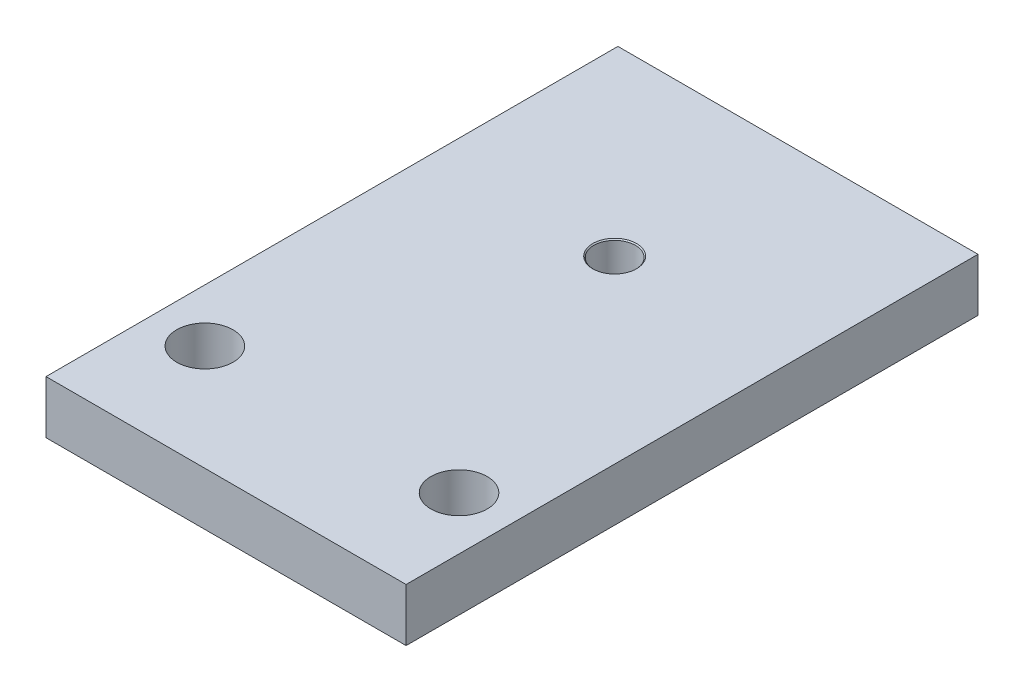
ISO-10303-21;
HEADER;
FILE_DESCRIPTION(('STEP AP214'),'2;1');
FILE_NAME('part.step','',(''),(''),'','','');
FILE_SCHEMA(('AUTOMOTIVE_DESIGN { 1 0 10303 214 1 1 1 1 }'));
ENDSEC;
DATA;
#1=APPLICATION_CONTEXT('core data for automotive mechanical design processes');
#2=APPLICATION_PROTOCOL_DEFINITION('international standard','automotive_design',2000,#1);
#3=PRODUCT_CONTEXT('',#1,'mechanical');
#4=PRODUCT('Part','Part','',(#3));
#5=PRODUCT_RELATED_PRODUCT_CATEGORY('part','',(#4));
#6=PRODUCT_DEFINITION_FORMATION('','',#4);
#7=PRODUCT_DEFINITION_CONTEXT('part definition',#1,'design');
#8=PRODUCT_DEFINITION('design','',#6,#7);
#9=PRODUCT_DEFINITION_SHAPE('','',#8);
#10=(LENGTH_UNIT() NAMED_UNIT(*) SI_UNIT(.MILLI.,.METRE.));
#11=(NAMED_UNIT(*) PLANE_ANGLE_UNIT() SI_UNIT($,.RADIAN.));
#12=(NAMED_UNIT(*) SI_UNIT($,.STERADIAN.) SOLID_ANGLE_UNIT());
#13=UNCERTAINTY_MEASURE_WITH_UNIT(LENGTH_MEASURE(1.E-05),#10,'distance_accuracy_value','');
#14=(GEOMETRIC_REPRESENTATION_CONTEXT(3) GLOBAL_UNCERTAINTY_ASSIGNED_CONTEXT((#13)) GLOBAL_UNIT_ASSIGNED_CONTEXT((#10,
#11,#12)) REPRESENTATION_CONTEXT('',''));
#15=CARTESIAN_POINT('',(0.,0.,0.));
#16=DIRECTION('',(0.,0.,1.));
#17=DIRECTION('',(1.,0.,0.));
#18=AXIS2_PLACEMENT_3D('',#15,#16,#17);
#19=CARTESIAN_POINT('',(-21.59,6.35,34.29));
#20=DIRECTION('',(1.,0.,0.));
#21=DIRECTION('',(0.,0.,-1.));
#22=AXIS2_PLACEMENT_3D('',#19,#20,#21);
#23=PLANE('',#22);
#24=DIRECTION('',(0.,0.,1.));
#25=VECTOR('',#24,1.);
#26=CARTESIAN_POINT('',(-21.59,0.,34.29));
#27=LINE('',#26,#25);
#28=CARTESIAN_POINT('',(-21.59,0.,-34.29));
#29=VERTEX_POINT('',#28);
#30=CARTESIAN_POINT('',(-21.59,0.,34.29));
#31=VERTEX_POINT('',#30);
#32=EDGE_CURVE('E104',#29,#31,#27,.T.);
#33=ORIENTED_EDGE('',*,*,#32,.T.);
#34=DIRECTION('',(0.,-1.,0.));
#35=VECTOR('',#34,1.);
#36=CARTESIAN_POINT('',(-21.59,6.35,34.29));
#37=LINE('',#36,#35);
#38=CARTESIAN_POINT('',(-21.59,6.35,34.29));
#39=VERTEX_POINT('',#38);
#40=EDGE_CURVE('E95',#39,#31,#37,.T.);
#41=ORIENTED_EDGE('',*,*,#40,.F.);
#42=DIRECTION('',(0.,0.,1.));
#43=VECTOR('',#42,1.);
#44=CARTESIAN_POINT('',(-21.59,6.35,34.29));
#45=LINE('',#44,#43);
#46=CARTESIAN_POINT('',(-21.59,6.35,-34.29));
#47=VERTEX_POINT('',#46);
#48=EDGE_CURVE('E89',#47,#39,#45,.T.);
#49=ORIENTED_EDGE('',*,*,#48,.F.);
#50=DIRECTION('',(0.,-1.,0.));
#51=VECTOR('',#50,1.);
#52=CARTESIAN_POINT('',(-21.59,6.35,-34.29));
#53=LINE('',#52,#51);
#54=EDGE_CURVE('E100',#47,#29,#53,.T.);
#55=ORIENTED_EDGE('',*,*,#54,.T.);
#56=EDGE_LOOP('',(#33,#41,#49,#55));
#57=FACE_BOUND('',#56,.T.);
#58=ADVANCED_FACE('F35',(#57),#23,.F.);
#59=CARTESIAN_POINT('',(21.59,6.35,34.29));
#60=DIRECTION('',(0.,0.,-1.));
#61=DIRECTION('',(-1.,0.,0.));
#62=AXIS2_PLACEMENT_3D('',#59,#60,#61);
#63=PLANE('',#62);
#64=DIRECTION('',(1.,0.,0.));
#65=VECTOR('',#64,1.);
#66=CARTESIAN_POINT('',(21.59,0.,34.29));
#67=LINE('',#66,#65);
#68=CARTESIAN_POINT('',(21.59,0.,34.29));
#69=VERTEX_POINT('',#68);
#70=EDGE_CURVE('E94',#31,#69,#67,.T.);
#71=ORIENTED_EDGE('',*,*,#70,.T.);
#72=DIRECTION('',(0.,-1.,0.));
#73=VECTOR('',#72,1.);
#74=CARTESIAN_POINT('',(21.59,6.35,34.29));
#75=LINE('',#74,#73);
#76=CARTESIAN_POINT('',(21.59,6.35,34.29));
#77=VERTEX_POINT('',#76);
#78=EDGE_CURVE('E92',#77,#69,#75,.T.);
#79=ORIENTED_EDGE('',*,*,#78,.F.);
#80=DIRECTION('',(1.,0.,0.));
#81=VECTOR('',#80,1.);
#82=CARTESIAN_POINT('',(21.59,6.35,34.29));
#83=LINE('',#82,#81);
#84=EDGE_CURVE('E84',#39,#77,#83,.T.);
#85=ORIENTED_EDGE('',*,*,#84,.F.);
#86=ORIENTED_EDGE('',*,*,#40,.T.);
#87=EDGE_LOOP('',(#71,#79,#85,#86));
#88=FACE_BOUND('',#87,.T.);
#89=ADVANCED_FACE('F93',(#88),#63,.F.);
#90=CARTESIAN_POINT('',(21.59,6.35,34.29));
#91=DIRECTION('',(-1.,0.,0.));
#92=DIRECTION('',(0.,0.,1.));
#93=AXIS2_PLACEMENT_3D('',#90,#91,#92);
#94=PLANE('',#93);
#95=DIRECTION('',(0.,0.,-1.));
#96=VECTOR('',#95,1.);
#97=CARTESIAN_POINT('',(21.59,0.,34.29));
#98=LINE('',#97,#96);
#99=CARTESIAN_POINT('',(21.59,0.,-34.29));
#100=VERTEX_POINT('',#99);
#101=EDGE_CURVE('E70',#69,#100,#98,.T.);
#102=ORIENTED_EDGE('',*,*,#101,.T.);
#103=DIRECTION('',(0.,-1.,0.));
#104=VECTOR('',#103,1.);
#105=CARTESIAN_POINT('',(21.59,6.35,-34.29));
#106=LINE('',#105,#104);
#107=CARTESIAN_POINT('',(21.59,6.35,-34.29));
#108=VERTEX_POINT('',#107);
#109=EDGE_CURVE('E96',#108,#100,#106,.T.);
#110=ORIENTED_EDGE('',*,*,#109,.F.);
#111=DIRECTION('',(0.,0.,-1.));
#112=VECTOR('',#111,1.);
#113=CARTESIAN_POINT('',(21.59,6.35,34.29));
#114=LINE('',#113,#112);
#115=EDGE_CURVE('E87',#77,#108,#114,.T.);
#116=ORIENTED_EDGE('',*,*,#115,.F.);
#117=ORIENTED_EDGE('',*,*,#78,.T.);
#118=EDGE_LOOP('',(#102,#110,#116,#117));
#119=FACE_BOUND('',#118,.T.);
#120=ADVANCED_FACE('F98',(#119),#94,.F.);
#121=CARTESIAN_POINT('',(21.59,6.35,-34.29));
#122=DIRECTION('',(0.,0.,1.));
#123=DIRECTION('',(1.,0.,0.));
#124=AXIS2_PLACEMENT_3D('',#121,#122,#123);
#125=PLANE('',#124);
#126=DIRECTION('',(-1.,0.,0.));
#127=VECTOR('',#126,1.);
#128=CARTESIAN_POINT('',(21.59,0.,-34.29));
#129=LINE('',#128,#127);
#130=EDGE_CURVE('E76',#100,#29,#129,.T.);
#131=ORIENTED_EDGE('',*,*,#130,.T.);
#132=ORIENTED_EDGE('',*,*,#54,.F.);
#133=DIRECTION('',(-1.,0.,0.));
#134=VECTOR('',#133,1.);
#135=CARTESIAN_POINT('',(21.59,6.35,-34.29));
#136=LINE('',#135,#134);
#137=EDGE_CURVE('E53',#108,#47,#136,.T.);
#138=ORIENTED_EDGE('',*,*,#137,.F.);
#139=ORIENTED_EDGE('',*,*,#109,.T.);
#140=EDGE_LOOP('',(#131,#132,#138,#139));
#141=FACE_BOUND('',#140,.T.);
#142=ADVANCED_FACE('F143',(#141),#125,.F.);
#143=CARTESIAN_POINT('',(0.,6.35,0.));
#144=DIRECTION('',(0.,1.,0.));
#145=DIRECTION('',(0.,0.,1.));
#146=AXIS2_PLACEMENT_3D('',#143,#144,#145);
#147=PLANE('',#146);
#148=CARTESIAN_POINT('',(0.,6.35,-12.31));
#149=DIRECTION('',(0.,1.,0.));
#150=DIRECTION('',(0.,0.,1.));
#151=AXIS2_PLACEMENT_3D('',#148,#149,#150);
#152=CIRCLE('',#151,2.62699999999996);
#153=CARTESIAN_POINT('',(0.,6.35,-9.68300000000003));
#154=VERTEX_POINT('',#153);
#155=EDGE_CURVE('E11',#154,#154,#152,.F.);
#156=ORIENTED_EDGE('',*,*,#155,.T.);
#157=EDGE_LOOP('',(#156));
#158=FACE_BOUND('',#157,.T.);
#159=CARTESIAN_POINT('',(-15.24,6.35,21.59));
#160=DIRECTION('',(0.,1.,0.));
#161=DIRECTION('',(0.,0.,1.));
#162=AXIS2_PLACEMENT_3D('',#159,#160,#161);
#163=CIRCLE('',#162,3.37819999999999);
#164=CARTESIAN_POINT('',(-15.24,6.35,24.9682));
#165=VERTEX_POINT('',#164);
#166=EDGE_CURVE('E148',#165,#165,#163,.T.);
#167=ORIENTED_EDGE('',*,*,#166,.F.);
#168=EDGE_LOOP('',(#167));
#169=FACE_BOUND('',#168,.T.);
#170=CARTESIAN_POINT('',(15.24,6.35,21.59));
#171=DIRECTION('',(0.,1.,0.));
#172=DIRECTION('',(0.,0.,1.));
#173=AXIS2_PLACEMENT_3D('',#170,#171,#172);
#174=CIRCLE('',#173,3.37819999999999);
#175=CARTESIAN_POINT('',(15.24,6.35,24.9682));
#176=VERTEX_POINT('',#175);
#177=EDGE_CURVE('E151',#176,#176,#174,.T.);
#178=ORIENTED_EDGE('',*,*,#177,.F.);
#179=EDGE_LOOP('',(#178));
#180=FACE_BOUND('',#179,.T.);
#181=ORIENTED_EDGE('',*,*,#48,.T.);
#182=ORIENTED_EDGE('',*,*,#84,.T.);
#183=ORIENTED_EDGE('',*,*,#115,.T.);
#184=ORIENTED_EDGE('',*,*,#137,.T.);
#185=EDGE_LOOP('',(#181,#182,#183,#184));
#186=FACE_BOUND('',#185,.T.);
#187=ADVANCED_FACE('F85',(#158,#169,#180,#186),#147,.T.);
#188=CARTESIAN_POINT('',(0.,0.,0.));
#189=DIRECTION('',(0.,1.,0.));
#190=DIRECTION('',(0.,0.,1.));
#191=AXIS2_PLACEMENT_3D('',#188,#189,#190);
#192=PLANE('',#191);
#193=CARTESIAN_POINT('',(0.,0.,-12.31));
#194=DIRECTION('',(0.,1.,0.));
#195=DIRECTION('',(0.,0.,1.));
#196=AXIS2_PLACEMENT_3D('',#193,#194,#195);
#197=CIRCLE('',#196,2.62700000000005);
#198=CARTESIAN_POINT('',(0.,0.,-9.68299999999994));
#199=VERTEX_POINT('',#198);
#200=EDGE_CURVE('E45',#199,#199,#197,.T.);
#201=ORIENTED_EDGE('',*,*,#200,.T.);
#202=EDGE_LOOP('',(#201));
#203=FACE_BOUND('',#202,.T.);
#204=CARTESIAN_POINT('',(-15.24,0.,21.59));
#205=DIRECTION('',(0.,1.,0.));
#206=DIRECTION('',(0.,0.,1.));
#207=AXIS2_PLACEMENT_3D('',#204,#205,#206);
#208=CIRCLE('',#207,3.3782);
#209=CARTESIAN_POINT('',(-15.24,0.,24.9682));
#210=VERTEX_POINT('',#209);
#211=EDGE_CURVE('E153',#210,#210,#208,.T.);
#212=ORIENTED_EDGE('',*,*,#211,.T.);
#213=EDGE_LOOP('',(#212));
#214=FACE_BOUND('',#213,.T.);
#215=CARTESIAN_POINT('',(15.24,0.,21.59));
#216=DIRECTION('',(0.,1.,0.));
#217=DIRECTION('',(0.,0.,1.));
#218=AXIS2_PLACEMENT_3D('',#215,#216,#217);
#219=CIRCLE('',#218,3.3782);
#220=CARTESIAN_POINT('',(15.24,0.,24.9682));
#221=VERTEX_POINT('',#220);
#222=EDGE_CURVE('E107',#221,#221,#219,.T.);
#223=ORIENTED_EDGE('',*,*,#222,.T.);
#224=EDGE_LOOP('',(#223));
#225=FACE_BOUND('',#224,.T.);
#226=ORIENTED_EDGE('',*,*,#32,.F.);
#227=ORIENTED_EDGE('',*,*,#130,.F.);
#228=ORIENTED_EDGE('',*,*,#101,.F.);
#229=ORIENTED_EDGE('',*,*,#70,.F.);
#230=EDGE_LOOP('',(#226,#227,#228,#229));
#231=FACE_BOUND('',#230,.T.);
#232=ADVANCED_FACE('F122',(#203,#214,#225,#231),#192,.F.);
#233=CARTESIAN_POINT('',(15.24,6.35,21.59));
#234=DIRECTION('',(0.,1.,0.));
#235=DIRECTION('',(0.,0.,1.));
#236=AXIS2_PLACEMENT_3D('',#233,#234,#235);
#237=CYLINDRICAL_SURFACE('',#236,3.37819999999999);
#238=ORIENTED_EDGE('',*,*,#222,.F.);
#239=EDGE_LOOP('',(#238));
#240=FACE_BOUND('',#239,.T.);
#241=ORIENTED_EDGE('',*,*,#177,.T.);
#242=EDGE_LOOP('',(#241));
#243=FACE_BOUND('',#242,.T.);
#244=ADVANCED_FACE('F162',(#240,#243),#237,.F.);
#245=CARTESIAN_POINT('',(-15.24,6.35,21.59));
#246=DIRECTION('',(0.,1.,0.));
#247=DIRECTION('',(0.,0.,1.));
#248=AXIS2_PLACEMENT_3D('',#245,#246,#247);
#249=CYLINDRICAL_SURFACE('',#248,3.37819999999999);
#250=ORIENTED_EDGE('',*,*,#211,.F.);
#251=EDGE_LOOP('',(#250));
#252=FACE_BOUND('',#251,.T.);
#253=ORIENTED_EDGE('',*,*,#166,.T.);
#254=EDGE_LOOP('',(#253));
#255=FACE_BOUND('',#254,.T.);
#256=ADVANCED_FACE('F133',(#252,#255),#249,.F.);
#257=CARTESIAN_POINT('',(0.,6.35,-12.31));
#258=DIRECTION('',(0.,-1.,0.));
#259=DIRECTION('',(0.,0.,-1.));
#260=AXIS2_PLACEMENT_3D('',#257,#258,#259);
#261=CYLINDRICAL_SURFACE('',#260,2.5);
#262=CARTESIAN_POINT('',(0.,0.127000000000046,-12.31));
#263=DIRECTION('',(0.,1.,0.));
#264=DIRECTION('',(0.,0.,1.));
#265=AXIS2_PLACEMENT_3D('',#262,#263,#264);
#266=CIRCLE('',#265,2.5);
#267=CARTESIAN_POINT('',(0.,0.127000000000046,-9.80999999999999));
#268=VERTEX_POINT('',#267);
#269=EDGE_CURVE('E117',#268,#268,#266,.F.);
#270=ORIENTED_EDGE('',*,*,#269,.T.);
#271=EDGE_LOOP('',(#270));
#272=FACE_BOUND('',#271,.T.);
#273=CARTESIAN_POINT('',(0.,6.22300000000004,-12.31));
#274=DIRECTION('',(0.,1.,0.));
#275=DIRECTION('',(0.,0.,1.));
#276=AXIS2_PLACEMENT_3D('',#273,#274,#275);
#277=CIRCLE('',#276,2.5);
#278=CARTESIAN_POINT('',(0.,6.22300000000004,-9.80999999999999));
#279=VERTEX_POINT('',#278);
#280=EDGE_CURVE('E114',#279,#279,#277,.T.);
#281=ORIENTED_EDGE('',*,*,#280,.T.);
#282=EDGE_LOOP('',(#281));
#283=FACE_BOUND('',#282,.T.);
#284=ADVANCED_FACE('F128',(#272,#283),#261,.F.);
#285=CARTESIAN_POINT('',(0.,0.127000000000046,-12.31));
#286=DIRECTION('',(0.,-1.,0.));
#287=DIRECTION('',(0.,0.,-1.));
#288=AXIS2_PLACEMENT_3D('',#285,#286,#287);
#289=CONICAL_SURFACE('',#288,2.5,0.785398163397464);
#290=ORIENTED_EDGE('',*,*,#200,.F.);
#291=EDGE_LOOP('',(#290));
#292=FACE_BOUND('',#291,.T.);
#293=ORIENTED_EDGE('',*,*,#269,.F.);
#294=EDGE_LOOP('',(#293));
#295=FACE_BOUND('',#294,.T.);
#296=ADVANCED_FACE('F125',(#292,#295),#289,.F.);
#297=CARTESIAN_POINT('',(0.,6.35,-12.31));
#298=DIRECTION('',(0.,1.,0.));
#299=DIRECTION('',(0.,0.,1.));
#300=AXIS2_PLACEMENT_3D('',#297,#298,#299);
#301=CONICAL_SURFACE('',#300,2.62699999999996,0.785398163397467);
#302=ORIENTED_EDGE('',*,*,#280,.F.);
#303=EDGE_LOOP('',(#302));
#304=FACE_BOUND('',#303,.T.);
#305=ORIENTED_EDGE('',*,*,#155,.F.);
#306=EDGE_LOOP('',(#305));
#307=FACE_BOUND('',#306,.T.);
#308=ADVANCED_FACE('F38',(#304,#307),#301,.F.);
#309=CLOSED_SHELL('',(#58,#89,#120,#142,#187,#232,#244,#256,#284,#296,#308));
#310=MANIFOLD_SOLID_BREP('B2',#309);
#311=ADVANCED_BREP_SHAPE_REPRESENTATION('',(#18,#310),#14);
#312=SHAPE_DEFINITION_REPRESENTATION(#9,#311);
ENDSEC;
END-ISO-10303-21;
